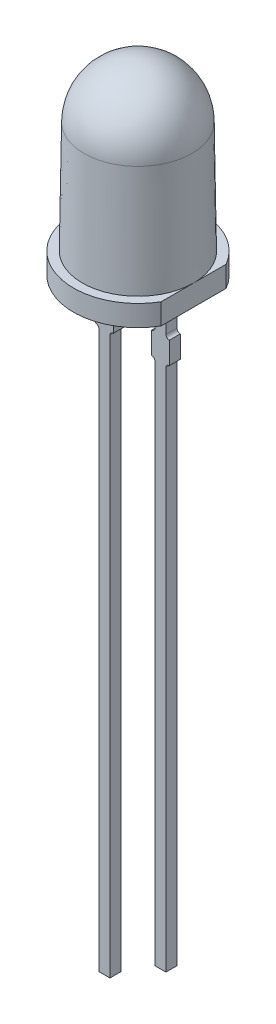
ISO-10303-21;
HEADER;
FILE_DESCRIPTION(('STEP AP214'),'2;1');
FILE_NAME('part.step','',(''),(''),'','','');
FILE_SCHEMA(('AUTOMOTIVE_DESIGN { 1 0 10303 214 1 1 1 1 }'));
ENDSEC;
DATA;
#1=APPLICATION_CONTEXT('core data for automotive mechanical design processes');
#2=APPLICATION_PROTOCOL_DEFINITION('international standard','automotive_design',2000,#1);
#3=PRODUCT_CONTEXT('',#1,'mechanical');
#4=PRODUCT('Part','Part','',(#3));
#5=PRODUCT_RELATED_PRODUCT_CATEGORY('part','',(#4));
#6=PRODUCT_DEFINITION_FORMATION('','',#4);
#7=PRODUCT_DEFINITION_CONTEXT('part definition',#1,'design');
#8=PRODUCT_DEFINITION('design','',#6,#7);
#9=PRODUCT_DEFINITION_SHAPE('','',#8);
#10=(LENGTH_UNIT() NAMED_UNIT(*) SI_UNIT(.MILLI.,.METRE.));
#11=(NAMED_UNIT(*) PLANE_ANGLE_UNIT() SI_UNIT($,.RADIAN.));
#12=(NAMED_UNIT(*) SI_UNIT($,.STERADIAN.) SOLID_ANGLE_UNIT());
#13=UNCERTAINTY_MEASURE_WITH_UNIT(LENGTH_MEASURE(1.E-05),#10,'distance_accuracy_value','');
#14=(GEOMETRIC_REPRESENTATION_CONTEXT(3) GLOBAL_UNCERTAINTY_ASSIGNED_CONTEXT((#13)) GLOBAL_UNIT_ASSIGNED_CONTEXT((#10,
#11,#12)) REPRESENTATION_CONTEXT('',''));
#15=CARTESIAN_POINT('',(0.,0.,0.));
#16=DIRECTION('',(0.,0.,1.));
#17=DIRECTION('',(1.,0.,0.));
#18=AXIS2_PLACEMENT_3D('',#15,#16,#17);
#19=CARTESIAN_POINT('',(1.92512672470002E-13,6.,0.));
#20=DIRECTION('',(1.,0.,0.));
#21=DIRECTION('',(0.,-0.707106781178281,0.707106781194814));
#22=AXIS2_PLACEMENT_3D('',#19,#20,#21);
#23=SPHERICAL_SURFACE('',#22,2.45);
#24=CARTESIAN_POINT('',(1.92512672470002E-13,6.,0.));
#25=DIRECTION('',(0.,-1.,0.));
#26=DIRECTION('',(0.,0.,-1.));
#27=AXIS2_PLACEMENT_3D('',#24,#25,#26);
#28=SPHERICAL_SURFACE('',#27,2.45);
#29=CARTESIAN_POINT('',(1.94072188874905E-13,5.99999999999,0.));
#30=DIRECTION('',(0.,-1.,0.));
#31=DIRECTION('',(0.,0.,-1.));
#32=AXIS2_PLACEMENT_3D('',#29,#30,#31);
#33=CIRCLE('',#32,2.45);
#34=CARTESIAN_POINT('',(-2.44999999999991,5.99999999999307,0.));
#35=VERTEX_POINT('',#34);
#36=CARTESIAN_POINT('',(2.4500000000002,5.99999999999075,0.));
#37=VERTEX_POINT('',#36);
#38=EDGE_CURVE('E10',#35,#37,#33,.T.);
#39=ORIENTED_EDGE('',*,*,#38,.F.);
#40=CARTESIAN_POINT('',(1.94072188874905E-13,5.99999999999,0.));
#41=DIRECTION('',(0.,-1.,0.));
#42=DIRECTION('',(0.,0.,-1.));
#43=AXIS2_PLACEMENT_3D('',#40,#41,#42);
#44=CIRCLE('',#43,2.45);
#45=EDGE_CURVE('E26',#37,#35,#44,.T.);
#46=ORIENTED_EDGE('',*,*,#45,.F.);
#47=EDGE_LOOP('',(#39,#46));
#48=FACE_BOUND('',#47,.T.);
#49=ADVANCED_FACE('F16',(#48),#28,.T.);
#50=CARTESIAN_POINT('',(1.94072188874905E-13,0.950000000045748,0.));
#51=DIRECTION('',(0.,-1.,0.));
#52=DIRECTION('',(0.,0.,-1.));
#53=AXIS2_PLACEMENT_3D('',#50,#51,#52);
#54=CONICAL_SURFACE('',#53,2.52499999999925,0.0148503933790926);
#55=ORIENTED_EDGE('',*,*,#38,.T.);
#56=ORIENTED_EDGE('',*,*,#45,.T.);
#57=EDGE_LOOP('',(#55,#56));
#58=FACE_BOUND('',#57,.T.);
#59=CARTESIAN_POINT('',(1.94072188874905E-13,0.950000000000018,0.));
#60=DIRECTION('',(0.,-1.,0.));
#61=DIRECTION('',(0.,0.,-1.));
#62=AXIS2_PLACEMENT_3D('',#59,#60,#61);
#63=CIRCLE('',#62,2.52499999999925);
#64=CARTESIAN_POINT('',(2.525,0.95000000000831,0.));
#65=VERTEX_POINT('',#64);
#66=EDGE_CURVE('E335',#65,#65,#63,.T.);
#67=ORIENTED_EDGE('',*,*,#66,.F.);
#68=EDGE_LOOP('',(#67));
#69=FACE_BOUND('',#68,.T.);
#70=ADVANCED_FACE('F483',(#58,#69),#54,.T.);
#71=CARTESIAN_POINT('',(-2.9249999999998,0.950000000000018,0.));
#72=DIRECTION('',(0.,-1.,0.));
#73=DIRECTION('',(0.,0.,-1.));
#74=AXIS2_PLACEMENT_3D('',#71,#72,#73);
#75=PLANE('',#74);
#76=DIRECTION('',(0.,0.,-1.));
#77=VECTOR('',#76,1.);
#78=CARTESIAN_POINT('',(2.525,0.950000000000018,1.));
#79=LINE('',#78,#77);
#80=CARTESIAN_POINT('',(2.525,0.950000000000018,1.47648230602366));
#81=VERTEX_POINT('',#80);
#82=EDGE_CURVE('E333',#81,#65,#79,.T.);
#83=ORIENTED_EDGE('',*,*,#82,.T.);
#84=ORIENTED_EDGE('',*,*,#66,.T.);
#85=DIRECTION('',(0.,0.,-1.));
#86=VECTOR('',#85,1.);
#87=CARTESIAN_POINT('',(2.525,0.950000000000018,1.));
#88=LINE('',#87,#86);
#89=CARTESIAN_POINT('',(2.525,0.950000000000018,-1.47648230602366));
#90=VERTEX_POINT('',#89);
#91=EDGE_CURVE('E344',#65,#90,#88,.T.);
#92=ORIENTED_EDGE('',*,*,#91,.T.);
#93=CARTESIAN_POINT('',(1.94062734631961E-13,0.950000000000018,0.));
#94=DIRECTION('',(0.,-1.,0.));
#95=DIRECTION('',(1.,0.,0.));
#96=AXIS2_PLACEMENT_3D('',#93,#94,#95);
#97=CIRCLE('',#96,2.925);
#98=EDGE_CURVE('E288',#81,#90,#97,.T.);
#99=ORIENTED_EDGE('',*,*,#98,.F.);
#100=EDGE_LOOP('',(#83,#84,#92,#99));
#101=FACE_BOUND('',#100,.T.);
#102=ADVANCED_FACE('F488',(#101),#75,.F.);
#103=CARTESIAN_POINT('',(-0.870004774559382,-1.45000372789603,-0.25));
#104=DIRECTION('',(0.,0.,1.));
#105=DIRECTION('',(1.,0.,0.));
#106=AXIS2_PLACEMENT_3D('',#103,#104,#105);
#107=CYLINDRICAL_SURFACE('',#106,0.149999999999983);
#108=CARTESIAN_POINT('',(-0.870004774559382,-1.45000372789603,0.25));
#109=DIRECTION('',(0.,0.,-1.));
#110=DIRECTION('',(1.,0.,0.));
#111=AXIS2_PLACEMENT_3D('',#108,#109,#110);
#112=CIRCLE('',#111,0.149999999999983);
#113=CARTESIAN_POINT('',(-0.870004774559366,-1.60000372789602,0.25));
#114=VERTEX_POINT('',#113);
#115=CARTESIAN_POINT('',(-1.02000477455937,-1.45000372789603,0.25));
#116=VERTEX_POINT('',#115);
#117=EDGE_CURVE('E368',#114,#116,#112,.T.);
#118=ORIENTED_EDGE('',*,*,#117,.F.);
#119=DIRECTION('',(0.,0.,1.));
#120=VECTOR('',#119,1.);
#121=CARTESIAN_POINT('',(-0.870004774559366,-1.60000372789602,-0.25));
#122=LINE('',#121,#120);
#123=CARTESIAN_POINT('',(-0.870004774559366,-1.60000372789602,-0.25));
#124=VERTEX_POINT('',#123);
#125=EDGE_CURVE('E222',#124,#114,#122,.T.);
#126=ORIENTED_EDGE('',*,*,#125,.F.);
#127=CARTESIAN_POINT('',(-0.870004774559382,-1.45000372789603,-0.25));
#128=DIRECTION('',(0.,0.,-1.));
#129=DIRECTION('',(1.,0.,0.));
#130=AXIS2_PLACEMENT_3D('',#127,#128,#129);
#131=CIRCLE('',#130,0.149999999999983);
#132=CARTESIAN_POINT('',(-1.02000477455937,-1.45000372789603,-0.25));
#133=VERTEX_POINT('',#132);
#134=EDGE_CURVE('E343',#124,#133,#131,.T.);
#135=ORIENTED_EDGE('',*,*,#134,.T.);
#136=DIRECTION('',(0.,0.,-1.));
#137=VECTOR('',#136,1.);
#138=CARTESIAN_POINT('',(-1.02000477455937,-1.45000372789603,-0.25));
#139=LINE('',#138,#137);
#140=EDGE_CURVE('E351',#116,#133,#139,.T.);
#141=ORIENTED_EDGE('',*,*,#140,.F.);
#142=EDGE_LOOP('',(#118,#126,#135,#141));
#143=FACE_BOUND('',#142,.T.);
#144=ADVANCED_FACE('F528',(#143),#107,.F.);
#145=CARTESIAN_POINT('',(-0.870004774559366,-2.60000274862627,-2.25688765043323));
#146=DIRECTION('',(-1.,0.,0.));
#147=DIRECTION('',(0.,0.,1.));
#148=AXIS2_PLACEMENT_3D('',#145,#146,#147);
#149=PLANE('',#148);
#150=ORIENTED_EDGE('',*,*,#125,.T.);
#151=DIRECTION('',(0.,1.,0.));
#152=VECTOR('',#151,1.);
#153=CARTESIAN_POINT('',(-0.870004774559366,0.275005784205525,0.25));
#154=LINE('',#153,#152);
#155=CARTESIAN_POINT('',(-0.870004774559366,-2.60000274886288,0.25));
#156=VERTEX_POINT('',#155);
#157=EDGE_CURVE('E244',#156,#114,#154,.T.);
#158=ORIENTED_EDGE('',*,*,#157,.F.);
#159=DIRECTION('',(0.,0.,1.));
#160=VECTOR('',#159,1.);
#161=CARTESIAN_POINT('',(-0.870004774559366,-2.60000274886288,-0.25));
#162=LINE('',#161,#160);
#163=CARTESIAN_POINT('',(-0.870004774559366,-2.60000274886288,-0.25));
#164=VERTEX_POINT('',#163);
#165=EDGE_CURVE('E266',#164,#156,#162,.T.);
#166=ORIENTED_EDGE('',*,*,#165,.F.);
#167=DIRECTION('',(0.,1.,0.));
#168=VECTOR('',#167,1.);
#169=CARTESIAN_POINT('',(-0.870004774559366,0.275005784205525,-0.25));
#170=LINE('',#169,#168);
#171=EDGE_CURVE('E219',#164,#124,#170,.T.);
#172=ORIENTED_EDGE('',*,*,#171,.T.);
#173=EDGE_LOOP('',(#150,#158,#166,#172));
#174=FACE_BOUND('',#173,.T.);
#175=ADVANCED_FACE('F531',(#174),#149,.F.);
#176=CARTESIAN_POINT('',(-0.869996349360989,-2.75000274862625,-0.25));
#177=DIRECTION('',(0.,0.,1.));
#178=DIRECTION('',(1.,0.,0.));
#179=AXIS2_PLACEMENT_3D('',#176,#177,#178);
#180=CYLINDRICAL_SURFACE('',#179,0.149999999999983);
#181=CARTESIAN_POINT('',(-0.869996349360989,-2.75000274862625,0.25));
#182=DIRECTION('',(0.,0.,-1.));
#183=DIRECTION('',(1.,0.,0.));
#184=AXIS2_PLACEMENT_3D('',#181,#182,#183);
#185=CIRCLE('',#184,0.149999999999983);
#186=CARTESIAN_POINT('',(-1.01999634936097,-2.75000274862625,0.25));
#187=VERTEX_POINT('',#186);
#188=EDGE_CURVE('E228',#187,#156,#185,.T.);
#189=ORIENTED_EDGE('',*,*,#188,.F.);
#190=DIRECTION('',(0.,0.,1.));
#191=VECTOR('',#190,1.);
#192=CARTESIAN_POINT('',(-1.01999634936097,-2.75000274862625,-0.25));
#193=LINE('',#192,#191);
#194=CARTESIAN_POINT('',(-1.01999634936097,-2.75000274862625,-0.25));
#195=VERTEX_POINT('',#194);
#196=EDGE_CURVE('E212',#195,#187,#193,.T.);
#197=ORIENTED_EDGE('',*,*,#196,.F.);
#198=CARTESIAN_POINT('',(-0.869996349360989,-2.75000274862625,-0.25));
#199=DIRECTION('',(0.,0.,-1.));
#200=DIRECTION('',(1.,0.,0.));
#201=AXIS2_PLACEMENT_3D('',#198,#199,#200);
#202=CIRCLE('',#201,0.149999999999983);
#203=EDGE_CURVE('E223',#195,#164,#202,.T.);
#204=ORIENTED_EDGE('',*,*,#203,.T.);
#205=ORIENTED_EDGE('',*,*,#165,.T.);
#206=EDGE_LOOP('',(#189,#197,#204,#205));
#207=FACE_BOUND('',#206,.T.);
#208=ADVANCED_FACE('F495',(#207),#180,.F.);
#209=CARTESIAN_POINT('',(-1.01999634936097,-28.0000027486262,-0.25));
#210=DIRECTION('',(1.,0.,0.));
#211=DIRECTION('',(0.,1.,0.));
#212=AXIS2_PLACEMENT_3D('',#209,#210,#211);
#213=PLANE('',#212);
#214=DIRECTION('',(0.,0.,-1.));
#215=VECTOR('',#214,1.);
#216=CARTESIAN_POINT('',(-1.01999634936097,-28.0000027486262,-0.25));
#217=LINE('',#216,#215);
#218=CARTESIAN_POINT('',(-1.01999634936097,-28.0000027486262,0.25));
#219=VERTEX_POINT('',#218);
#220=CARTESIAN_POINT('',(-1.01999634936097,-28.0000027486262,-0.25));
#221=VERTEX_POINT('',#220);
#222=EDGE_CURVE('E269',#219,#221,#217,.T.);
#223=ORIENTED_EDGE('',*,*,#222,.T.);
#224=DIRECTION('',(0.,1.,0.));
#225=VECTOR('',#224,1.);
#226=CARTESIAN_POINT('',(-1.01999634936097,-12.4249942157945,-0.25));
#227=LINE('',#226,#225);
#228=EDGE_CURVE('E314',#221,#195,#227,.T.);
#229=ORIENTED_EDGE('',*,*,#228,.T.);
#230=ORIENTED_EDGE('',*,*,#196,.T.);
#231=DIRECTION('',(0.,-1.,0.));
#232=VECTOR('',#231,1.);
#233=CARTESIAN_POINT('',(-1.01999634936097,-12.4249942157945,0.25));
#234=LINE('',#233,#232);
#235=EDGE_CURVE('E209',#187,#219,#234,.T.);
#236=ORIENTED_EDGE('',*,*,#235,.T.);
#237=EDGE_LOOP('',(#223,#229,#230,#236));
#238=FACE_BOUND('',#237,.T.);
#239=ADVANCED_FACE('F467',(#238),#213,.T.);
#240=CARTESIAN_POINT('',(-1.51999634936097,-28.0000027486262,-0.25));
#241=DIRECTION('',(0.,-1.,0.));
#242=DIRECTION('',(0.,0.,-1.));
#243=AXIS2_PLACEMENT_3D('',#240,#241,#242);
#244=PLANE('',#243);
#245=DIRECTION('',(0.,0.,-1.));
#246=VECTOR('',#245,1.);
#247=CARTESIAN_POINT('',(-1.51999634936097,-28.0000027486262,-0.25));
#248=LINE('',#247,#246);
#249=CARTESIAN_POINT('',(-1.51999634936097,-28.0000027486262,0.25));
#250=VERTEX_POINT('',#249);
#251=CARTESIAN_POINT('',(-1.51999634936097,-28.0000027486262,-0.25));
#252=VERTEX_POINT('',#251);
#253=EDGE_CURVE('E213',#250,#252,#248,.T.);
#254=ORIENTED_EDGE('',*,*,#253,.T.);
#255=DIRECTION('',(1.,0.,0.));
#256=VECTOR('',#255,1.);
#257=CARTESIAN_POINT('',(-0.739998884975231,-28.0000027486262,-0.25));
#258=LINE('',#257,#256);
#259=EDGE_CURVE('E275',#252,#221,#258,.T.);
#260=ORIENTED_EDGE('',*,*,#259,.T.);
#261=ORIENTED_EDGE('',*,*,#222,.F.);
#262=DIRECTION('',(-1.,0.,0.));
#263=VECTOR('',#262,1.);
#264=CARTESIAN_POINT('',(-0.739998884975231,-28.0000027486262,0.25));
#265=LINE('',#264,#263);
#266=EDGE_CURVE('E277',#219,#250,#265,.T.);
#267=ORIENTED_EDGE('',*,*,#266,.T.);
#268=EDGE_LOOP('',(#254,#260,#261,#267));
#269=FACE_BOUND('',#268,.T.);
#270=ADVANCED_FACE('F469',(#269),#244,.T.);
#271=CARTESIAN_POINT('',(-1.51999634936097,-28.0000027486262,-0.25));
#272=DIRECTION('',(-1.,0.,0.));
#273=DIRECTION('',(0.,0.,1.));
#274=AXIS2_PLACEMENT_3D('',#271,#272,#273);
#275=PLANE('',#274);
#276=DIRECTION('',(0.,0.,-1.));
#277=VECTOR('',#276,1.);
#278=CARTESIAN_POINT('',(-1.51999634936097,-2.75000274862625,-0.25));
#279=LINE('',#278,#277);
#280=CARTESIAN_POINT('',(-1.51999634936097,-2.75000274862625,0.25));
#281=VERTEX_POINT('',#280);
#282=CARTESIAN_POINT('',(-1.51999634936097,-2.75000274862625,-0.25));
#283=VERTEX_POINT('',#282);
#284=EDGE_CURVE('E252',#281,#283,#279,.T.);
#285=ORIENTED_EDGE('',*,*,#284,.T.);
#286=DIRECTION('',(0.,-1.,0.));
#287=VECTOR('',#286,1.);
#288=CARTESIAN_POINT('',(-1.51999634936097,-12.4249942157945,-0.25));
#289=LINE('',#288,#287);
#290=EDGE_CURVE('E248',#283,#252,#289,.T.);
#291=ORIENTED_EDGE('',*,*,#290,.T.);
#292=ORIENTED_EDGE('',*,*,#253,.F.);
#293=DIRECTION('',(0.,1.,0.));
#294=VECTOR('',#293,1.);
#295=CARTESIAN_POINT('',(-1.51999634936097,-12.4249942157945,0.25));
#296=LINE('',#295,#294);
#297=EDGE_CURVE('E245',#250,#281,#296,.T.);
#298=ORIENTED_EDGE('',*,*,#297,.T.);
#299=EDGE_LOOP('',(#285,#291,#292,#298));
#300=FACE_BOUND('',#299,.T.);
#301=ADVANCED_FACE('F470',(#300),#275,.T.);
#302=CARTESIAN_POINT('',(-1.66999634936093,-2.75000274862625,-0.25));
#303=DIRECTION('',(0.,0.,1.));
#304=DIRECTION('',(1.,0.,0.));
#305=AXIS2_PLACEMENT_3D('',#302,#303,#304);
#306=CYLINDRICAL_SURFACE('',#305,0.149999999999956);
#307=CARTESIAN_POINT('',(-1.66999634936093,-2.75000274862625,0.25));
#308=DIRECTION('',(0.,0.,-1.));
#309=DIRECTION('',(1.,0.,0.));
#310=AXIS2_PLACEMENT_3D('',#307,#308,#309);
#311=CIRCLE('',#310,0.149999999999956);
#312=CARTESIAN_POINT('',(-1.66999634936104,-2.6000027486263,0.25));
#313=VERTEX_POINT('',#312);
#314=EDGE_CURVE('E224',#313,#281,#311,.T.);
#315=ORIENTED_EDGE('',*,*,#314,.F.);
#316=DIRECTION('',(0.,0.,1.));
#317=VECTOR('',#316,1.);
#318=CARTESIAN_POINT('',(-1.66999634936104,-2.6000027486263,-0.25));
#319=LINE('',#318,#317);
#320=CARTESIAN_POINT('',(-1.66999634936104,-2.6000027486263,-0.25));
#321=VERTEX_POINT('',#320);
#322=EDGE_CURVE('E350',#321,#313,#319,.T.);
#323=ORIENTED_EDGE('',*,*,#322,.F.);
#324=CARTESIAN_POINT('',(-1.66999634936093,-2.75000274862625,-0.25));
#325=DIRECTION('',(0.,0.,-1.));
#326=DIRECTION('',(1.,0.,0.));
#327=AXIS2_PLACEMENT_3D('',#324,#325,#326);
#328=CIRCLE('',#327,0.149999999999956);
#329=EDGE_CURVE('E249',#321,#283,#328,.T.);
#330=ORIENTED_EDGE('',*,*,#329,.T.);
#331=ORIENTED_EDGE('',*,*,#284,.F.);
#332=EDGE_LOOP('',(#315,#323,#330,#331));
#333=FACE_BOUND('',#332,.T.);
#334=ADVANCED_FACE('F432',(#333),#306,.F.);
#335=CARTESIAN_POINT('',(-1.66999634936104,-2.6000027486263,-0.25));
#336=DIRECTION('',(-1.,0.,0.));
#337=DIRECTION('',(0.,0.,1.));
#338=AXIS2_PLACEMENT_3D('',#335,#336,#337);
#339=PLANE('',#338);
#340=DIRECTION('',(0.,0.,-1.));
#341=VECTOR('',#340,1.);
#342=CARTESIAN_POINT('',(-1.66999634936104,-1.60000274862629,-0.25));
#343=LINE('',#342,#341);
#344=CARTESIAN_POINT('',(-1.66999634936104,-1.60000274862629,0.25));
#345=VERTEX_POINT('',#344);
#346=CARTESIAN_POINT('',(-1.66999634936104,-1.60000274862629,-0.25));
#347=VERTEX_POINT('',#346);
#348=EDGE_CURVE('E207',#345,#347,#343,.T.);
#349=ORIENTED_EDGE('',*,*,#348,.T.);
#350=DIRECTION('',(0.,-1.,0.));
#351=VECTOR('',#350,1.);
#352=CARTESIAN_POINT('',(-1.66999634936104,0.275005784205511,-0.25));
#353=LINE('',#352,#351);
#354=EDGE_CURVE('E347',#347,#321,#353,.T.);
#355=ORIENTED_EDGE('',*,*,#354,.T.);
#356=ORIENTED_EDGE('',*,*,#322,.T.);
#357=DIRECTION('',(0.,1.,0.));
#358=VECTOR('',#357,1.);
#359=CARTESIAN_POINT('',(-1.66999634936104,0.275005784205511,0.25));
#360=LINE('',#359,#358);
#361=EDGE_CURVE('E20',#313,#345,#360,.T.);
#362=ORIENTED_EDGE('',*,*,#361,.T.);
#363=EDGE_LOOP('',(#349,#355,#356,#362));
#364=FACE_BOUND('',#363,.T.);
#365=ADVANCED_FACE('F413',(#364),#339,.T.);
#366=CARTESIAN_POINT('',(-1.66999634936093,-1.45000274862634,-0.25));
#367=DIRECTION('',(0.,0.,1.));
#368=DIRECTION('',(1.,0.,0.));
#369=AXIS2_PLACEMENT_3D('',#366,#367,#368);
#370=CYLINDRICAL_SURFACE('',#369,0.149999999999956);
#371=CARTESIAN_POINT('',(-1.66999634936093,-1.45000274862634,0.25));
#372=DIRECTION('',(0.,0.,-1.));
#373=DIRECTION('',(1.,0.,0.));
#374=AXIS2_PLACEMENT_3D('',#371,#372,#373);
#375=CIRCLE('',#374,0.149999999999956);
#376=CARTESIAN_POINT('',(-1.51999634936097,-1.45000274862634,0.25));
#377=VERTEX_POINT('',#376);
#378=EDGE_CURVE('E227',#377,#345,#375,.T.);
#379=ORIENTED_EDGE('',*,*,#378,.F.);
#380=DIRECTION('',(0.,0.,1.));
#381=VECTOR('',#380,1.);
#382=CARTESIAN_POINT('',(-1.51999634936097,-1.45000274862634,-0.25));
#383=LINE('',#382,#381);
#384=CARTESIAN_POINT('',(-1.51999634936097,-1.45000274862634,-0.25));
#385=VERTEX_POINT('',#384);
#386=EDGE_CURVE('E260',#385,#377,#383,.T.);
#387=ORIENTED_EDGE('',*,*,#386,.F.);
#388=CARTESIAN_POINT('',(-1.66999634936093,-1.45000274862634,-0.25));
#389=DIRECTION('',(0.,0.,-1.));
#390=DIRECTION('',(1.,0.,0.));
#391=AXIS2_PLACEMENT_3D('',#388,#389,#390);
#392=CIRCLE('',#391,0.149999999999956);
#393=EDGE_CURVE('E360',#385,#347,#392,.T.);
#394=ORIENTED_EDGE('',*,*,#393,.T.);
#395=ORIENTED_EDGE('',*,*,#348,.F.);
#396=EDGE_LOOP('',(#379,#387,#394,#395));
#397=FACE_BOUND('',#396,.T.);
#398=ADVANCED_FACE('F417',(#397),#370,.F.);
#399=CARTESIAN_POINT('',(0.869995225440637,-1.45000372789603,-0.25));
#400=DIRECTION('',(0.,0.,1.));
#401=DIRECTION('',(1.,0.,0.));
#402=AXIS2_PLACEMENT_3D('',#399,#400,#401);
#403=CYLINDRICAL_SURFACE('',#402,0.149999999999983);
#404=CARTESIAN_POINT('',(0.869995225440637,-1.45000372789603,0.25));
#405=DIRECTION('',(0.,0.,-1.));
#406=DIRECTION('',(1.,0.,0.));
#407=AXIS2_PLACEMENT_3D('',#404,#405,#406);
#408=CIRCLE('',#407,0.149999999999983);
#409=CARTESIAN_POINT('',(1.01999522544062,-1.45000372789603,0.25));
#410=VERTEX_POINT('',#409);
#411=CARTESIAN_POINT('',(0.869995225440621,-1.60000372789602,0.25));
#412=VERTEX_POINT('',#411);
#413=EDGE_CURVE('E292',#410,#412,#408,.T.);
#414=ORIENTED_EDGE('',*,*,#413,.F.);
#415=DIRECTION('',(0.,0.,1.));
#416=VECTOR('',#415,1.);
#417=CARTESIAN_POINT('',(1.01999522544062,-1.45000372789603,-0.25));
#418=LINE('',#417,#416);
#419=CARTESIAN_POINT('',(1.01999522544062,-1.45000372789603,-0.25));
#420=VERTEX_POINT('',#419);
#421=EDGE_CURVE('E234',#420,#410,#418,.T.);
#422=ORIENTED_EDGE('',*,*,#421,.F.);
#423=CARTESIAN_POINT('',(0.869995225440637,-1.45000372789603,-0.25));
#424=DIRECTION('',(0.,0.,-1.));
#425=DIRECTION('',(1.,0.,0.));
#426=AXIS2_PLACEMENT_3D('',#423,#424,#425);
#427=CIRCLE('',#426,0.149999999999983);
#428=CARTESIAN_POINT('',(0.869995225440621,-1.60000372789602,-0.25));
#429=VERTEX_POINT('',#428);
#430=EDGE_CURVE('E265',#420,#429,#427,.T.);
#431=ORIENTED_EDGE('',*,*,#430,.T.);
#432=DIRECTION('',(0.,0.,-1.));
#433=VECTOR('',#432,1.);
#434=CARTESIAN_POINT('',(0.869995225440621,-1.60000372789602,-0.25));
#435=LINE('',#434,#433);
#436=EDGE_CURVE('E237',#412,#429,#435,.T.);
#437=ORIENTED_EDGE('',*,*,#436,.F.);
#438=EDGE_LOOP('',(#414,#422,#431,#437));
#439=FACE_BOUND('',#438,.T.);
#440=ADVANCED_FACE('F526',(#439),#403,.F.);
#441=CARTESIAN_POINT('',(1.670003650639,-1.45000274862628,-0.25));
#442=DIRECTION('',(0.,0.,1.));
#443=DIRECTION('',(1.,0.,0.));
#444=AXIS2_PLACEMENT_3D('',#441,#442,#443);
#445=CYLINDRICAL_SURFACE('',#444,0.149999999999862);
#446=CARTESIAN_POINT('',(1.670003650639,-1.45000274862628,0.25));
#447=DIRECTION('',(0.,0.,-1.));
#448=DIRECTION('',(1.,0.,0.));
#449=AXIS2_PLACEMENT_3D('',#446,#447,#448);
#450=CIRCLE('',#449,0.149999999999862);
#451=CARTESIAN_POINT('',(1.67000365063905,-1.60000274862614,0.25));
#452=VERTEX_POINT('',#451);
#453=CARTESIAN_POINT('',(1.5200036506393,-1.45000296876312,0.25));
#454=VERTEX_POINT('',#453);
#455=EDGE_CURVE('E230',#452,#454,#450,.T.);
#456=ORIENTED_EDGE('',*,*,#455,.F.);
#457=DIRECTION('',(0.,0.,1.));
#458=VECTOR('',#457,1.);
#459=CARTESIAN_POINT('',(1.67000365063905,-1.60000274862614,-0.25));
#460=LINE('',#459,#458);
#461=CARTESIAN_POINT('',(1.67000365063905,-1.60000274862614,-0.25));
#462=VERTEX_POINT('',#461);
#463=EDGE_CURVE('E217',#462,#452,#460,.T.);
#464=ORIENTED_EDGE('',*,*,#463,.F.);
#465=CARTESIAN_POINT('',(1.670003650639,-1.45000274862628,-0.25));
#466=DIRECTION('',(0.,0.,-1.));
#467=DIRECTION('',(1.,0.,0.));
#468=AXIS2_PLACEMENT_3D('',#465,#466,#467);
#469=CIRCLE('',#468,0.149999999999862);
#470=CARTESIAN_POINT('',(1.52000365063934,-1.45000296876312,-0.25));
#471=VERTEX_POINT('',#470);
#472=EDGE_CURVE('E262',#462,#471,#469,.T.);
#473=ORIENTED_EDGE('',*,*,#472,.T.);
#474=DIRECTION('',(0.,0.,-1.));
#475=VECTOR('',#474,1.);
#476=CARTESIAN_POINT('',(1.52000365063934,-1.45000296876312,-0.25));
#477=LINE('',#476,#475);
#478=EDGE_CURVE('E289',#454,#471,#477,.T.);
#479=ORIENTED_EDGE('',*,*,#478,.F.);
#480=EDGE_LOOP('',(#456,#464,#473,#479));
#481=FACE_BOUND('',#480,.T.);
#482=ADVANCED_FACE('F523',(#481),#445,.F.);
#483=CARTESIAN_POINT('',(1.67000365063905,-2.60000274862627,-0.25));
#484=DIRECTION('',(1.,0.,0.));
#485=DIRECTION('',(0.,1.,0.));
#486=AXIS2_PLACEMENT_3D('',#483,#484,#485);
#487=PLANE('',#486);
#488=DIRECTION('',(0.,0.,-1.));
#489=VECTOR('',#488,1.);
#490=CARTESIAN_POINT('',(1.67000365063905,-2.60000274862627,-0.25));
#491=LINE('',#490,#489);
#492=CARTESIAN_POINT('',(1.67000365063905,-2.60000274862627,0.25));
#493=VERTEX_POINT('',#492);
#494=CARTESIAN_POINT('',(1.67000365063905,-2.60000274862627,-0.25));
#495=VERTEX_POINT('',#494);
#496=EDGE_CURVE('E216',#493,#495,#491,.T.);
#497=ORIENTED_EDGE('',*,*,#496,.T.);
#498=DIRECTION('',(0.,1.,0.));
#499=VECTOR('',#498,1.);
#500=CARTESIAN_POINT('',(1.67000365063905,0.275005784205525,-0.25));
#501=LINE('',#500,#499);
#502=EDGE_CURVE('E214',#495,#462,#501,.T.);
#503=ORIENTED_EDGE('',*,*,#502,.T.);
#504=ORIENTED_EDGE('',*,*,#463,.T.);
#505=DIRECTION('',(0.,1.,0.));
#506=VECTOR('',#505,1.);
#507=CARTESIAN_POINT('',(1.67000365063905,0.275005784205525,0.25));
#508=LINE('',#507,#506);
#509=EDGE_CURVE('E117',#493,#452,#508,.T.);
#510=ORIENTED_EDGE('',*,*,#509,.F.);
#511=EDGE_LOOP('',(#497,#503,#504,#510));
#512=FACE_BOUND('',#511,.T.);
#513=ADVANCED_FACE('F518',(#512),#487,.T.);
#514=CARTESIAN_POINT('',(1.670003650639,-2.75000274862625,-0.25));
#515=DIRECTION('',(0.,0.,1.));
#516=DIRECTION('',(1.,0.,0.));
#517=AXIS2_PLACEMENT_3D('',#514,#515,#516);
#518=CYLINDRICAL_SURFACE('',#517,0.149999999999983);
#519=CARTESIAN_POINT('',(1.670003650639,-2.75000274862625,0.25));
#520=DIRECTION('',(0.,0.,-1.));
#521=DIRECTION('',(1.,0.,0.));
#522=AXIS2_PLACEMENT_3D('',#519,#520,#521);
#523=CIRCLE('',#522,0.149999999999983);
#524=CARTESIAN_POINT('',(1.52000365063902,-2.75000274862625,0.25));
#525=VERTEX_POINT('',#524);
#526=EDGE_CURVE('E128',#525,#493,#523,.T.);
#527=ORIENTED_EDGE('',*,*,#526,.F.);
#528=DIRECTION('',(0.,0.,1.));
#529=VECTOR('',#528,1.);
#530=CARTESIAN_POINT('',(1.52000365063902,-2.75000274862625,-0.25));
#531=LINE('',#530,#529);
#532=CARTESIAN_POINT('',(1.52000365063902,-2.75000274862625,-0.25));
#533=VERTEX_POINT('',#532);
#534=EDGE_CURVE('E185',#533,#525,#531,.T.);
#535=ORIENTED_EDGE('',*,*,#534,.F.);
#536=CARTESIAN_POINT('',(1.670003650639,-2.75000274862625,-0.25));
#537=DIRECTION('',(0.,0.,-1.));
#538=DIRECTION('',(1.,0.,0.));
#539=AXIS2_PLACEMENT_3D('',#536,#537,#538);
#540=CIRCLE('',#539,0.149999999999983);
#541=EDGE_CURVE('E182',#533,#495,#540,.T.);
#542=ORIENTED_EDGE('',*,*,#541,.T.);
#543=ORIENTED_EDGE('',*,*,#496,.F.);
#544=EDGE_LOOP('',(#527,#535,#542,#543));
#545=FACE_BOUND('',#544,.T.);
#546=ADVANCED_FACE('F537',(#545),#518,.F.);
#547=CARTESIAN_POINT('',(1.52000365063902,-2.75000274862625,-0.25));
#548=DIRECTION('',(1.,0.,0.));
#549=DIRECTION('',(0.,1.,0.));
#550=AXIS2_PLACEMENT_3D('',#547,#548,#549);
#551=PLANE('',#550);
#552=DIRECTION('',(0.,0.,-1.));
#553=VECTOR('',#552,1.);
#554=CARTESIAN_POINT('',(1.52000365063902,-26.5000027486263,-0.25));
#555=LINE('',#554,#553);
#556=CARTESIAN_POINT('',(1.52000365063902,-26.5000027486263,0.25));
#557=VERTEX_POINT('',#556);
#558=CARTESIAN_POINT('',(1.52000365063902,-26.5000027486263,-0.25));
#559=VERTEX_POINT('',#558);
#560=EDGE_CURVE('E184',#557,#559,#555,.T.);
#561=ORIENTED_EDGE('',*,*,#560,.T.);
#562=DIRECTION('',(0.,1.,0.));
#563=VECTOR('',#562,1.);
#564=CARTESIAN_POINT('',(1.52000365063902,0.200005784205533,-0.25));
#565=LINE('',#564,#563);
#566=EDGE_CURVE('E174',#559,#533,#565,.T.);
#567=ORIENTED_EDGE('',*,*,#566,.T.);
#568=ORIENTED_EDGE('',*,*,#534,.T.);
#569=DIRECTION('',(0.,1.,0.));
#570=VECTOR('',#569,1.);
#571=CARTESIAN_POINT('',(1.52000365063902,0.200005784205533,0.25));
#572=LINE('',#571,#570);
#573=EDGE_CURVE('E190',#557,#525,#572,.T.);
#574=ORIENTED_EDGE('',*,*,#573,.F.);
#575=EDGE_LOOP('',(#561,#567,#568,#574));
#576=FACE_BOUND('',#575,.T.);
#577=ADVANCED_FACE('F188',(#576),#551,.T.);
#578=CARTESIAN_POINT('',(1.02000365063901,-26.5000027486263,-0.25));
#579=DIRECTION('',(0.,-1.,0.));
#580=DIRECTION('',(0.,0.,-1.));
#581=AXIS2_PLACEMENT_3D('',#578,#579,#580);
#582=PLANE('',#581);
#583=DIRECTION('',(0.,0.,-1.));
#584=VECTOR('',#583,1.);
#585=CARTESIAN_POINT('',(1.02000365063901,-26.5000027486263,-0.25));
#586=LINE('',#585,#584);
#587=CARTESIAN_POINT('',(1.02000365063901,-26.5000027486263,0.25));
#588=VERTEX_POINT('',#587);
#589=CARTESIAN_POINT('',(1.02000365063901,-26.5000027486263,-0.25));
#590=VERTEX_POINT('',#589);
#591=EDGE_CURVE('E197',#588,#590,#586,.T.);
#592=ORIENTED_EDGE('',*,*,#591,.T.);
#593=DIRECTION('',(1.,0.,0.));
#594=VECTOR('',#593,1.);
#595=CARTESIAN_POINT('',(0.530001115024762,-26.5000027486263,-0.25));
#596=LINE('',#595,#594);
#597=EDGE_CURVE('E179',#590,#559,#596,.T.);
#598=ORIENTED_EDGE('',*,*,#597,.T.);
#599=ORIENTED_EDGE('',*,*,#560,.F.);
#600=DIRECTION('',(1.,0.,0.));
#601=VECTOR('',#600,1.);
#602=CARTESIAN_POINT('',(0.530001115024762,-26.5000027486263,0.25));
#603=LINE('',#602,#601);
#604=EDGE_CURVE('E239',#588,#557,#603,.T.);
#605=ORIENTED_EDGE('',*,*,#604,.F.);
#606=EDGE_LOOP('',(#592,#598,#599,#605));
#607=FACE_BOUND('',#606,.T.);
#608=ADVANCED_FACE('F195',(#607),#582,.T.);
#609=CARTESIAN_POINT('',(1.02000365063901,-26.5000027486263,-0.25));
#610=DIRECTION('',(-1.,0.,0.));
#611=DIRECTION('',(0.,0.,1.));
#612=AXIS2_PLACEMENT_3D('',#609,#610,#611);
#613=PLANE('',#612);
#614=DIRECTION('',(0.,0.,-1.));
#615=VECTOR('',#614,1.);
#616=CARTESIAN_POINT('',(1.02000365063901,-2.75000274862625,-0.25));
#617=LINE('',#616,#615);
#618=CARTESIAN_POINT('',(1.02000365063901,-2.75000274862625,0.25));
#619=VERTEX_POINT('',#618);
#620=CARTESIAN_POINT('',(1.02000365063901,-2.75000274862625,-0.25));
#621=VERTEX_POINT('',#620);
#622=EDGE_CURVE('E199',#619,#621,#617,.T.);
#623=ORIENTED_EDGE('',*,*,#622,.T.);
#624=DIRECTION('',(0.,-1.,0.));
#625=VECTOR('',#624,1.);
#626=CARTESIAN_POINT('',(1.02000365063901,-11.6749942157945,-0.25));
#627=LINE('',#626,#625);
#628=EDGE_CURVE('E203',#621,#590,#627,.T.);
#629=ORIENTED_EDGE('',*,*,#628,.T.);
#630=ORIENTED_EDGE('',*,*,#591,.F.);
#631=DIRECTION('',(0.,-1.,0.));
#632=VECTOR('',#631,1.);
#633=CARTESIAN_POINT('',(1.02000365063901,-11.6749942157945,0.25));
#634=LINE('',#633,#632);
#635=EDGE_CURVE('E240',#619,#588,#634,.T.);
#636=ORIENTED_EDGE('',*,*,#635,.F.);
#637=EDGE_LOOP('',(#623,#629,#630,#636));
#638=FACE_BOUND('',#637,.T.);
#639=ADVANCED_FACE('F501',(#638),#613,.T.);
#640=CARTESIAN_POINT('',(0.87000365063903,-2.75000274862625,-0.25));
#641=DIRECTION('',(0.,0.,1.));
#642=DIRECTION('',(1.,0.,0.));
#643=AXIS2_PLACEMENT_3D('',#640,#641,#642);
#644=CYLINDRICAL_SURFACE('',#643,0.149999999999983);
#645=CARTESIAN_POINT('',(0.87000365063903,-2.75000274862625,0.25));
#646=DIRECTION('',(0.,0.,-1.));
#647=DIRECTION('',(1.,0.,0.));
#648=AXIS2_PLACEMENT_3D('',#645,#646,#647);
#649=CIRCLE('',#648,0.149999999999983);
#650=CARTESIAN_POINT('',(0.869995225440621,-2.60000274886288,0.25));
#651=VERTEX_POINT('',#650);
#652=EDGE_CURVE('E302',#651,#619,#649,.T.);
#653=ORIENTED_EDGE('',*,*,#652,.F.);
#654=DIRECTION('',(0.,0.,1.));
#655=VECTOR('',#654,1.);
#656=CARTESIAN_POINT('',(0.869995225440621,-2.60000274886288,-0.25));
#657=LINE('',#656,#655);
#658=CARTESIAN_POINT('',(0.869995225440621,-2.60000274886288,-0.25));
#659=VERTEX_POINT('',#658);
#660=EDGE_CURVE('E254',#659,#651,#657,.T.);
#661=ORIENTED_EDGE('',*,*,#660,.F.);
#662=CARTESIAN_POINT('',(0.87000365063903,-2.75000274862625,-0.25));
#663=DIRECTION('',(0.,0.,1.));
#664=DIRECTION('',(1.,0.,0.));
#665=AXIS2_PLACEMENT_3D('',#662,#663,#664);
#666=CIRCLE('',#665,0.149999999999983);
#667=EDGE_CURVE('E283',#621,#659,#666,.T.);
#668=ORIENTED_EDGE('',*,*,#667,.F.);
#669=ORIENTED_EDGE('',*,*,#622,.F.);
#670=EDGE_LOOP('',(#653,#661,#668,#669));
#671=FACE_BOUND('',#670,.T.);
#672=ADVANCED_FACE('F504',(#671),#644,.F.);
#673=CARTESIAN_POINT('',(0.869995225440621,-2.60000274862627,-2.25688765043323));
#674=DIRECTION('',(1.,0.,0.));
#675=DIRECTION('',(0.,1.,0.));
#676=AXIS2_PLACEMENT_3D('',#673,#674,#675);
#677=PLANE('',#676);
#678=ORIENTED_EDGE('',*,*,#660,.T.);
#679=DIRECTION('',(0.,-1.,0.));
#680=VECTOR('',#679,1.);
#681=CARTESIAN_POINT('',(0.869995225440621,0.275005784205525,0.25));
#682=LINE('',#681,#680);
#683=EDGE_CURVE('E294',#412,#651,#682,.T.);
#684=ORIENTED_EDGE('',*,*,#683,.F.);
#685=ORIENTED_EDGE('',*,*,#436,.T.);
#686=DIRECTION('',(0.,1.,0.));
#687=VECTOR('',#686,1.);
#688=CARTESIAN_POINT('',(0.869995225440621,0.275005784205525,-0.25));
#689=LINE('',#688,#687);
#690=EDGE_CURVE('E290',#659,#429,#689,.T.);
#691=ORIENTED_EDGE('',*,*,#690,.F.);
#692=EDGE_LOOP('',(#678,#684,#685,#691));
#693=FACE_BOUND('',#692,.T.);
#694=ADVANCED_FACE('F507',(#693),#677,.F.);
#695=CARTESIAN_POINT('',(1.01999522544062,-1.45000372789603,-0.25));
#696=DIRECTION('',(-1.,0.,0.));
#697=DIRECTION('',(0.,0.,1.));
#698=AXIS2_PLACEMENT_3D('',#695,#696,#697);
#699=PLANE('',#698);
#700=ORIENTED_EDGE('',*,*,#421,.T.);
#701=DIRECTION('',(0.,1.,0.));
#702=VECTOR('',#701,1.);
#703=CARTESIAN_POINT('',(1.01999522544062,0.850005294570641,0.25));
#704=LINE('',#703,#702);
#705=CARTESIAN_POINT('',(1.01999522544062,0.,0.25));
#706=VERTEX_POINT('',#705);
#707=EDGE_CURVE('E238',#410,#706,#704,.T.);
#708=ORIENTED_EDGE('',*,*,#707,.T.);
#709=DIRECTION('',(0.,0.,-1.));
#710=VECTOR('',#709,1.);
#711=CARTESIAN_POINT('',(1.01999522544062,0.,-0.125));
#712=LINE('',#711,#710);
#713=CARTESIAN_POINT('',(1.01999522544062,0.,-0.25));
#714=VERTEX_POINT('',#713);
#715=EDGE_CURVE('E282',#706,#714,#712,.T.);
#716=ORIENTED_EDGE('',*,*,#715,.T.);
#717=DIRECTION('',(0.,-1.,0.));
#718=VECTOR('',#717,1.);
#719=CARTESIAN_POINT('',(1.01999522544062,0.850005294570641,-0.25));
#720=LINE('',#719,#718);
#721=EDGE_CURVE('E279',#714,#420,#720,.T.);
#722=ORIENTED_EDGE('',*,*,#721,.T.);
#723=EDGE_LOOP('',(#700,#708,#716,#722));
#724=FACE_BOUND('',#723,.T.);
#725=ADVANCED_FACE('F453',(#724),#699,.T.);
#726=CARTESIAN_POINT('',(0.03999857941051,3.15001431703732,-0.25));
#727=DIRECTION('',(0.,0.,1.));
#728=DIRECTION('',(1.,0.,0.));
#729=AXIS2_PLACEMENT_3D('',#726,#727,#728);
#730=PLANE('',#729);
#731=DIRECTION('',(-1.,0.,0.));
#732=VECTOR('',#731,1.);
#733=CARTESIAN_POINT('',(-1.44250071029464,0.,-0.25));
#734=LINE('',#733,#732);
#735=CARTESIAN_POINT('',(1.52000152264557,0.,-0.25));
#736=VERTEX_POINT('',#735);
#737=EDGE_CURVE('E273',#736,#714,#734,.T.);
#738=ORIENTED_EDGE('',*,*,#737,.F.);
#739=DIRECTION('',(-1.46757889890877E-06,0.999999999998923,0.));
#740=VECTOR('',#739,1.);
#741=CARTESIAN_POINT('',(1.51999686739007,3.17206489851289,-0.25));
#742=LINE('',#741,#740);
#743=EDGE_CURVE('E291',#471,#736,#742,.T.);
#744=ORIENTED_EDGE('',*,*,#743,.F.);
#745=ORIENTED_EDGE('',*,*,#472,.F.);
#746=ORIENTED_EDGE('',*,*,#502,.F.);
#747=ORIENTED_EDGE('',*,*,#541,.F.);
#748=ORIENTED_EDGE('',*,*,#566,.F.);
#749=ORIENTED_EDGE('',*,*,#597,.F.);
#750=ORIENTED_EDGE('',*,*,#628,.F.);
#751=ORIENTED_EDGE('',*,*,#667,.T.);
#752=ORIENTED_EDGE('',*,*,#690,.T.);
#753=ORIENTED_EDGE('',*,*,#430,.F.);
#754=ORIENTED_EDGE('',*,*,#721,.F.);
#755=EDGE_LOOP('',(#738,#744,#745,#746,#747,#748,#749,#750,#751,#752,#753,#754));
#756=FACE_BOUND('',#755,.T.);
#757=ADVANCED_FACE('F177',(#756),#730,.F.);
#758=CARTESIAN_POINT('',(1.51999683503228,3.19411330797417,-0.25));
#759=DIRECTION('',(0.999999999998923,1.46757889890877E-06,0.));
#760=DIRECTION('',(0.,0.,-1.));
#761=AXIS2_PLACEMENT_3D('',#758,#759,#760);
#762=PLANE('',#761);
#763=ORIENTED_EDGE('',*,*,#478,.T.);
#764=ORIENTED_EDGE('',*,*,#743,.T.);
#765=DIRECTION('',(0.,0.,1.));
#766=VECTOR('',#765,1.);
#767=CARTESIAN_POINT('',(1.52000152264557,0.,-0.125));
#768=LINE('',#767,#766);
#769=CARTESIAN_POINT('',(1.52000152264557,0.,0.25));
#770=VERTEX_POINT('',#769);
#771=EDGE_CURVE('E232',#736,#770,#768,.T.);
#772=ORIENTED_EDGE('',*,*,#771,.T.);
#773=DIRECTION('',(-1.46757889890877E-06,0.999999999998923,0.));
#774=VECTOR('',#773,1.);
#775=CARTESIAN_POINT('',(1.51999686739007,3.17206489851289,0.25));
#776=LINE('',#775,#774);
#777=EDGE_CURVE('E233',#454,#770,#776,.T.);
#778=ORIENTED_EDGE('',*,*,#777,.F.);
#779=EDGE_LOOP('',(#763,#764,#772,#778));
#780=FACE_BOUND('',#779,.T.);
#781=ADVANCED_FACE('F449',(#780),#762,.T.);
#782=CARTESIAN_POINT('',(0.03999857941051,3.15001431703732,0.25));
#783=DIRECTION('',(0.,0.,1.));
#784=DIRECTION('',(1.,0.,0.));
#785=AXIS2_PLACEMENT_3D('',#782,#783,#784);
#786=PLANE('',#785);
#787=ORIENTED_EDGE('',*,*,#455,.T.);
#788=ORIENTED_EDGE('',*,*,#777,.T.);
#789=DIRECTION('',(-1.,0.,0.));
#790=VECTOR('',#789,1.);
#791=CARTESIAN_POINT('',(-1.44250071029464,0.,0.25));
#792=LINE('',#791,#790);
#793=EDGE_CURVE('E293',#770,#706,#792,.T.);
#794=ORIENTED_EDGE('',*,*,#793,.T.);
#795=ORIENTED_EDGE('',*,*,#707,.F.);
#796=ORIENTED_EDGE('',*,*,#413,.T.);
#797=ORIENTED_EDGE('',*,*,#683,.T.);
#798=ORIENTED_EDGE('',*,*,#652,.T.);
#799=ORIENTED_EDGE('',*,*,#635,.T.);
#800=ORIENTED_EDGE('',*,*,#604,.T.);
#801=ORIENTED_EDGE('',*,*,#573,.T.);
#802=ORIENTED_EDGE('',*,*,#526,.T.);
#803=ORIENTED_EDGE('',*,*,#509,.T.);
#804=EDGE_LOOP('',(#787,#788,#794,#795,#796,#797,#798,#799,#800,#801,#802,#803));
#805=FACE_BOUND('',#804,.T.);
#806=ADVANCED_FACE('F387',(#805),#786,.T.);
#807=CARTESIAN_POINT('',(0.03999857941051,3.15001431703732,-0.25));
#808=DIRECTION('',(0.,0.,1.));
#809=DIRECTION('',(1.,0.,0.));
#810=AXIS2_PLACEMENT_3D('',#807,#808,#809);
#811=PLANE('',#810);
#812=DIRECTION('',(1.,0.,0.));
#813=VECTOR('',#812,1.);
#814=CARTESIAN_POINT('',(-1.44250071029464,0.,-0.25));
#815=LINE('',#814,#813);
#816=CARTESIAN_POINT('',(-1.51999634936097,0.,-0.25));
#817=VERTEX_POINT('',#816);
#818=CARTESIAN_POINT('',(-1.02000477455937,0.,-0.25));
#819=VERTEX_POINT('',#818);
#820=EDGE_CURVE('E354',#817,#819,#815,.T.);
#821=ORIENTED_EDGE('',*,*,#820,.T.);
#822=DIRECTION('',(0.,1.,0.));
#823=VECTOR('',#822,1.);
#824=CARTESIAN_POINT('',(-1.02000477455937,0.850005294570641,-0.25));
#825=LINE('',#824,#823);
#826=EDGE_CURVE('E355',#133,#819,#825,.T.);
#827=ORIENTED_EDGE('',*,*,#826,.F.);
#828=ORIENTED_EDGE('',*,*,#134,.F.);
#829=ORIENTED_EDGE('',*,*,#171,.F.);
#830=ORIENTED_EDGE('',*,*,#203,.F.);
#831=ORIENTED_EDGE('',*,*,#228,.F.);
#832=ORIENTED_EDGE('',*,*,#259,.F.);
#833=ORIENTED_EDGE('',*,*,#290,.F.);
#834=ORIENTED_EDGE('',*,*,#329,.F.);
#835=ORIENTED_EDGE('',*,*,#354,.F.);
#836=ORIENTED_EDGE('',*,*,#393,.F.);
#837=DIRECTION('',(0.,-1.,0.));
#838=VECTOR('',#837,1.);
#839=CARTESIAN_POINT('',(-1.51999634936097,0.850005784205489,-0.25));
#840=LINE('',#839,#838);
#841=EDGE_CURVE('E261',#817,#385,#840,.T.);
#842=ORIENTED_EDGE('',*,*,#841,.F.);
#843=EDGE_LOOP('',(#821,#827,#828,#829,#830,#831,#832,#833,#834,#835,#836,#842));
#844=FACE_BOUND('',#843,.T.);
#845=ADVANCED_FACE('F426',(#844),#811,.F.);
#846=CARTESIAN_POINT('',(-1.02000477455937,-1.45000372789603,-0.25));
#847=DIRECTION('',(1.,0.,0.));
#848=DIRECTION('',(0.,1.,0.));
#849=AXIS2_PLACEMENT_3D('',#846,#847,#848);
#850=PLANE('',#849);
#851=ORIENTED_EDGE('',*,*,#140,.T.);
#852=ORIENTED_EDGE('',*,*,#826,.T.);
#853=DIRECTION('',(0.,0.,1.));
#854=VECTOR('',#853,1.);
#855=CARTESIAN_POINT('',(-1.02000477455937,0.,-0.125));
#856=LINE('',#855,#854);
#857=CARTESIAN_POINT('',(-1.02000477455937,0.,0.25));
#858=VERTEX_POINT('',#857);
#859=EDGE_CURVE('E365',#819,#858,#856,.T.);
#860=ORIENTED_EDGE('',*,*,#859,.T.);
#861=DIRECTION('',(0.,1.,0.));
#862=VECTOR('',#861,1.);
#863=CARTESIAN_POINT('',(-1.02000477455937,0.850005294570641,0.25));
#864=LINE('',#863,#862);
#865=EDGE_CURVE('E325',#116,#858,#864,.T.);
#866=ORIENTED_EDGE('',*,*,#865,.F.);
#867=EDGE_LOOP('',(#851,#852,#860,#866));
#868=FACE_BOUND('',#867,.T.);
#869=ADVANCED_FACE('F500',(#868),#850,.T.);
#870=CARTESIAN_POINT('',(0.03999857941051,3.15001431703732,0.25));
#871=DIRECTION('',(0.,0.,1.));
#872=DIRECTION('',(1.,0.,0.));
#873=AXIS2_PLACEMENT_3D('',#870,#871,#872);
#874=PLANE('',#873);
#875=ORIENTED_EDGE('',*,*,#117,.T.);
#876=ORIENTED_EDGE('',*,*,#865,.T.);
#877=DIRECTION('',(-1.,0.,0.));
#878=VECTOR('',#877,1.);
#879=CARTESIAN_POINT('',(-1.44250071029464,0.,0.25));
#880=LINE('',#879,#878);
#881=CARTESIAN_POINT('',(-1.51999634936097,0.,0.25));
#882=VERTEX_POINT('',#881);
#883=EDGE_CURVE('E322',#858,#882,#880,.T.);
#884=ORIENTED_EDGE('',*,*,#883,.T.);
#885=DIRECTION('',(0.,-1.,0.));
#886=VECTOR('',#885,1.);
#887=CARTESIAN_POINT('',(-1.51999634936097,0.850005784205489,0.25));
#888=LINE('',#887,#886);
#889=EDGE_CURVE('E326',#882,#377,#888,.T.);
#890=ORIENTED_EDGE('',*,*,#889,.T.);
#891=ORIENTED_EDGE('',*,*,#378,.T.);
#892=ORIENTED_EDGE('',*,*,#361,.F.);
#893=ORIENTED_EDGE('',*,*,#314,.T.);
#894=ORIENTED_EDGE('',*,*,#297,.F.);
#895=ORIENTED_EDGE('',*,*,#266,.F.);
#896=ORIENTED_EDGE('',*,*,#235,.F.);
#897=ORIENTED_EDGE('',*,*,#188,.T.);
#898=ORIENTED_EDGE('',*,*,#157,.T.);
#899=EDGE_LOOP('',(#875,#876,#884,#890,#891,#892,#893,#894,#895,#896,#897,#898));
#900=FACE_BOUND('',#899,.T.);
#901=ADVANCED_FACE('F418',(#900),#874,.T.);
#902=CARTESIAN_POINT('',(-1.51999634936097,-1.45000274862634,-0.25));
#903=DIRECTION('',(-1.,0.,0.));
#904=DIRECTION('',(0.,0.,1.));
#905=AXIS2_PLACEMENT_3D('',#902,#903,#904);
#906=PLANE('',#905);
#907=ORIENTED_EDGE('',*,*,#386,.T.);
#908=ORIENTED_EDGE('',*,*,#889,.F.);
#909=DIRECTION('',(0.,0.,-1.));
#910=VECTOR('',#909,1.);
#911=CARTESIAN_POINT('',(-1.51999634936097,0.,-0.125));
#912=LINE('',#911,#910);
#913=EDGE_CURVE('E257',#882,#817,#912,.T.);
#914=ORIENTED_EDGE('',*,*,#913,.T.);
#915=ORIENTED_EDGE('',*,*,#841,.T.);
#916=EDGE_LOOP('',(#907,#908,#914,#915));
#917=FACE_BOUND('',#916,.T.);
#918=ADVANCED_FACE('F423',(#917),#906,.T.);
#919=CARTESIAN_POINT('',(-2.9249999999998,0.,0.));
#920=DIRECTION('',(0.,1.,0.));
#921=DIRECTION('',(1.,0.,0.));
#922=AXIS2_PLACEMENT_3D('',#919,#920,#921);
#923=PLANE('',#922);
#924=CARTESIAN_POINT('',(1.94062734631961E-13,0.,0.));
#925=DIRECTION('',(0.,1.,0.));
#926=DIRECTION('',(1.,0.,0.));
#927=AXIS2_PLACEMENT_3D('',#924,#925,#926);
#928=CIRCLE('',#927,2.925);
#929=CARTESIAN_POINT('',(2.525,0.,-1.47648230602366));
#930=VERTEX_POINT('',#929);
#931=CARTESIAN_POINT('',(2.525,0.,1.47648230602366));
#932=VERTEX_POINT('',#931);
#933=EDGE_CURVE('E284',#930,#932,#928,.T.);
#934=ORIENTED_EDGE('',*,*,#933,.F.);
#935=DIRECTION('',(0.,0.,-1.));
#936=VECTOR('',#935,1.);
#937=CARTESIAN_POINT('',(2.525,0.,1.));
#938=LINE('',#937,#936);
#939=EDGE_CURVE('E287',#932,#930,#938,.T.);
#940=ORIENTED_EDGE('',*,*,#939,.F.);
#941=EDGE_LOOP('',(#934,#940));
#942=FACE_BOUND('',#941,.T.);
#943=ORIENTED_EDGE('',*,*,#913,.F.);
#944=ORIENTED_EDGE('',*,*,#883,.F.);
#945=ORIENTED_EDGE('',*,*,#859,.F.);
#946=ORIENTED_EDGE('',*,*,#820,.F.);
#947=EDGE_LOOP('',(#943,#944,#945,#946));
#948=FACE_BOUND('',#947,.T.);
#949=ORIENTED_EDGE('',*,*,#793,.F.);
#950=ORIENTED_EDGE('',*,*,#771,.F.);
#951=ORIENTED_EDGE('',*,*,#737,.T.);
#952=ORIENTED_EDGE('',*,*,#715,.F.);
#953=EDGE_LOOP('',(#949,#950,#951,#952));
#954=FACE_BOUND('',#953,.T.);
#955=ADVANCED_FACE('F18',(#942,#948,#954),#923,.F.);
#956=CARTESIAN_POINT('',(2.525,0.,2.));
#957=DIRECTION('',(1.,0.,0.));
#958=DIRECTION('',(0.,1.,0.));
#959=AXIS2_PLACEMENT_3D('',#956,#957,#958);
#960=PLANE('',#959);
#961=DIRECTION('',(0.,1.,0.));
#962=VECTOR('',#961,1.);
#963=CARTESIAN_POINT('',(2.525,0.,-1.47648230602366));
#964=LINE('',#963,#962);
#965=EDGE_CURVE('E270',#930,#90,#964,.T.);
#966=ORIENTED_EDGE('',*,*,#965,.T.);
#967=ORIENTED_EDGE('',*,*,#91,.F.);
#968=ORIENTED_EDGE('',*,*,#82,.F.);
#969=DIRECTION('',(0.,-1.,0.));
#970=VECTOR('',#969,1.);
#971=CARTESIAN_POINT('',(2.525,0.,1.47648230602366));
#972=LINE('',#971,#970);
#973=EDGE_CURVE('E274',#81,#932,#972,.T.);
#974=ORIENTED_EDGE('',*,*,#973,.T.);
#975=ORIENTED_EDGE('',*,*,#939,.T.);
#976=EDGE_LOOP('',(#966,#967,#968,#974,#975));
#977=FACE_BOUND('',#976,.T.);
#978=ADVANCED_FACE('F549',(#977),#960,.T.);
#979=CARTESIAN_POINT('',(1.94062734631961E-13,0.,0.));
#980=DIRECTION('',(0.,-1.,0.));
#981=DIRECTION('',(1.,0.,0.));
#982=AXIS2_PLACEMENT_3D('',#979,#980,#981);
#983=CYLINDRICAL_SURFACE('',#982,2.925);
#984=ORIENTED_EDGE('',*,*,#965,.F.);
#985=ORIENTED_EDGE('',*,*,#933,.T.);
#986=ORIENTED_EDGE('',*,*,#973,.F.);
#987=ORIENTED_EDGE('',*,*,#98,.T.);
#988=EDGE_LOOP('',(#984,#985,#986,#987));
#989=FACE_BOUND('',#988,.T.);
#990=ADVANCED_FACE('F546',(#989),#983,.T.);
#991=CLOSED_SHELL('',(#49,#70,#102,#144,#175,#208,#239,#270,#301,#334,#365,#398,#440,#482,#513,
#546,#577,#608,#639,#672,#694,#725,#757,#781,#806,#845,#869,#901,#918,#955,#978,#990));
#992=MANIFOLD_SOLID_BREP('B1',#991);
#993=ADVANCED_BREP_SHAPE_REPRESENTATION('',(#18,#992),#14);
#994=SHAPE_DEFINITION_REPRESENTATION(#9,#993);
ENDSEC;
END-ISO-10303-21;
